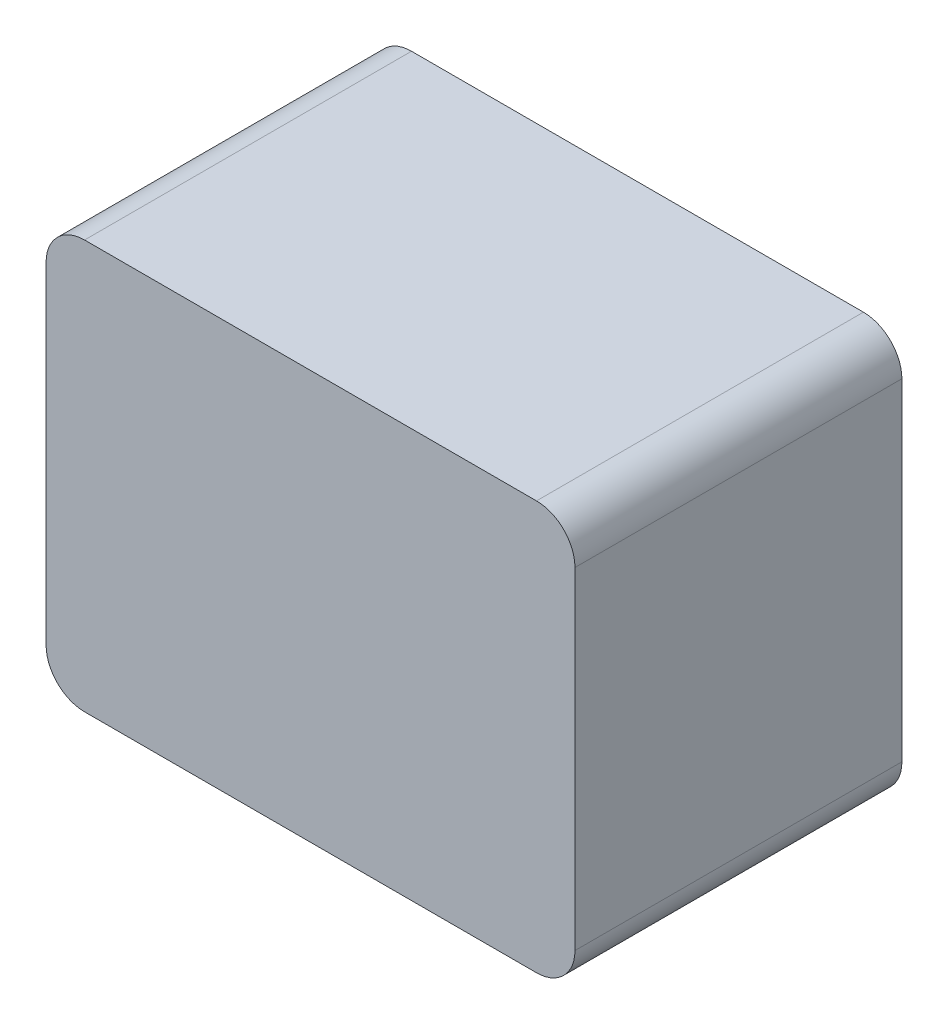
ISO-10303-21;
HEADER;
FILE_DESCRIPTION(('STEP AP214'),'2;1');
FILE_NAME('part.step','',(''),(''),'','','');
FILE_SCHEMA(('AUTOMOTIVE_DESIGN { 1 0 10303 214 1 1 1 1 }'));
ENDSEC;
DATA;
#1=APPLICATION_CONTEXT('core data for automotive mechanical design processes');
#2=APPLICATION_PROTOCOL_DEFINITION('international standard','automotive_design',2000,#1);
#3=PRODUCT_CONTEXT('',#1,'mechanical');
#4=PRODUCT('Part','Part','',(#3));
#5=PRODUCT_RELATED_PRODUCT_CATEGORY('part','',(#4));
#6=PRODUCT_DEFINITION_FORMATION('','',#4);
#7=PRODUCT_DEFINITION_CONTEXT('part definition',#1,'design');
#8=PRODUCT_DEFINITION('design','',#6,#7);
#9=PRODUCT_DEFINITION_SHAPE('','',#8);
#10=(LENGTH_UNIT() NAMED_UNIT(*) SI_UNIT(.MILLI.,.METRE.));
#11=(NAMED_UNIT(*) PLANE_ANGLE_UNIT() SI_UNIT($,.RADIAN.));
#12=(NAMED_UNIT(*) SI_UNIT($,.STERADIAN.) SOLID_ANGLE_UNIT());
#13=UNCERTAINTY_MEASURE_WITH_UNIT(LENGTH_MEASURE(1.E-05),#10,'distance_accuracy_value','');
#14=(GEOMETRIC_REPRESENTATION_CONTEXT(3) GLOBAL_UNCERTAINTY_ASSIGNED_CONTEXT((#13)) GLOBAL_UNIT_ASSIGNED_CONTEXT((#10,
#11,#12)) REPRESENTATION_CONTEXT('',''));
#15=CARTESIAN_POINT('',(0.,0.,0.));
#16=DIRECTION('',(0.,0.,1.));
#17=DIRECTION('',(1.,0.,0.));
#18=AXIS2_PLACEMENT_3D('',#15,#16,#17);
#19=CARTESIAN_POINT('',(-1.2120253164557,-8.88291139240506,68.));
#20=DIRECTION('',(0.,0.,-1.));
#21=DIRECTION('',(-1.,0.,0.));
#22=AXIS2_PLACEMENT_3D('',#19,#20,#21);
#23=CYLINDRICAL_SURFACE('',#22,8.);
#24=CARTESIAN_POINT('',(-1.2120253164557,-8.88291139240506,0.));
#25=DIRECTION('',(0.,0.,1.));
#26=DIRECTION('',(1.,0.,0.));
#27=AXIS2_PLACEMENT_3D('',#24,#25,#26);
#28=CIRCLE('',#27,8.);
#29=CARTESIAN_POINT('',(-1.21202531645575,-16.8829113924051,0.));
#30=VERTEX_POINT('',#29);
#31=CARTESIAN_POINT('',(6.7879746835443,-8.88291139240501,0.));
#32=VERTEX_POINT('',#31);
#33=EDGE_CURVE('E131',#30,#32,#28,.T.);
#34=ORIENTED_EDGE('',*,*,#33,.T.);
#35=DIRECTION('',(0.,0.,-1.));
#36=VECTOR('',#35,1.);
#37=CARTESIAN_POINT('',(6.7879746835443,-8.88291139240501,68.));
#38=LINE('',#37,#36);
#39=CARTESIAN_POINT('',(6.7879746835443,-8.88291139240501,68.));
#40=VERTEX_POINT('',#39);
#41=EDGE_CURVE('E11',#40,#32,#38,.T.);
#42=ORIENTED_EDGE('',*,*,#41,.F.);
#43=CARTESIAN_POINT('',(-1.2120253164557,-8.88291139240506,68.));
#44=DIRECTION('',(0.,0.,1.));
#45=DIRECTION('',(1.,0.,0.));
#46=AXIS2_PLACEMENT_3D('',#43,#44,#45);
#47=CIRCLE('',#46,8.);
#48=CARTESIAN_POINT('',(-1.21202531645575,-16.8829113924051,68.));
#49=VERTEX_POINT('',#48);
#50=EDGE_CURVE('E145',#49,#40,#47,.T.);
#51=ORIENTED_EDGE('',*,*,#50,.F.);
#52=DIRECTION('',(0.,0.,-1.));
#53=VECTOR('',#52,1.);
#54=CARTESIAN_POINT('',(-1.21202531645575,-16.8829113924051,68.));
#55=LINE('',#54,#53);
#56=EDGE_CURVE('E127',#49,#30,#55,.T.);
#57=ORIENTED_EDGE('',*,*,#56,.T.);
#58=EDGE_LOOP('',(#34,#42,#51,#57));
#59=FACE_BOUND('',#58,.T.);
#60=ADVANCED_FACE('F35',(#59),#23,.T.);
#61=CARTESIAN_POINT('',(6.7879746835443,60.1170886075949,68.));
#62=DIRECTION('',(-1.,0.,0.));
#63=DIRECTION('',(0.,-1.,0.));
#64=AXIS2_PLACEMENT_3D('',#61,#62,#63);
#65=PLANE('',#64);
#66=DIRECTION('',(0.,1.,0.));
#67=VECTOR('',#66,1.);
#68=CARTESIAN_POINT('',(6.7879746835443,60.1170886075949,0.));
#69=LINE('',#68,#67);
#70=CARTESIAN_POINT('',(6.7879746835443,60.1170886075949,0.));
#71=VERTEX_POINT('',#70);
#72=EDGE_CURVE('E134',#32,#71,#69,.T.);
#73=ORIENTED_EDGE('',*,*,#72,.T.);
#74=DIRECTION('',(0.,0.,-1.));
#75=VECTOR('',#74,1.);
#76=CARTESIAN_POINT('',(6.7879746835443,60.1170886075949,68.));
#77=LINE('',#76,#75);
#78=CARTESIAN_POINT('',(6.7879746835443,60.1170886075949,68.));
#79=VERTEX_POINT('',#78);
#80=EDGE_CURVE('E43',#79,#71,#77,.T.);
#81=ORIENTED_EDGE('',*,*,#80,.F.);
#82=DIRECTION('',(0.,1.,0.));
#83=VECTOR('',#82,1.);
#84=CARTESIAN_POINT('',(6.7879746835443,60.1170886075949,68.));
#85=LINE('',#84,#83);
#86=EDGE_CURVE('E94',#40,#79,#85,.T.);
#87=ORIENTED_EDGE('',*,*,#86,.F.);
#88=ORIENTED_EDGE('',*,*,#41,.T.);
#89=EDGE_LOOP('',(#73,#81,#87,#88));
#90=FACE_BOUND('',#89,.T.);
#91=ADVANCED_FACE('F180',(#90),#65,.F.);
#92=CARTESIAN_POINT('',(-1.2120253164557,60.1170886075949,68.));
#93=DIRECTION('',(0.,0.,-1.));
#94=DIRECTION('',(-1.,0.,0.));
#95=AXIS2_PLACEMENT_3D('',#92,#93,#94);
#96=CYLINDRICAL_SURFACE('',#95,8.);
#97=CARTESIAN_POINT('',(-1.2120253164557,60.1170886075949,0.));
#98=DIRECTION('',(0.,0.,1.));
#99=DIRECTION('',(-1.,0.,0.));
#100=AXIS2_PLACEMENT_3D('',#97,#98,#99);
#101=CIRCLE('',#100,8.);
#102=CARTESIAN_POINT('',(-1.21202531645576,68.1170886075949,0.));
#103=VERTEX_POINT('',#102);
#104=EDGE_CURVE('E136',#71,#103,#101,.T.);
#105=ORIENTED_EDGE('',*,*,#104,.T.);
#106=DIRECTION('',(0.,0.,-1.));
#107=VECTOR('',#106,1.);
#108=CARTESIAN_POINT('',(-1.21202531645576,68.1170886075949,68.));
#109=LINE('',#108,#107);
#110=CARTESIAN_POINT('',(-1.21202531645576,68.1170886075949,68.));
#111=VERTEX_POINT('',#110);
#112=EDGE_CURVE('E152',#111,#103,#109,.T.);
#113=ORIENTED_EDGE('',*,*,#112,.F.);
#114=CARTESIAN_POINT('',(-1.2120253164557,60.1170886075949,68.));
#115=DIRECTION('',(0.,0.,1.));
#116=DIRECTION('',(-1.,0.,0.));
#117=AXIS2_PLACEMENT_3D('',#114,#115,#116);
#118=CIRCLE('',#117,8.);
#119=EDGE_CURVE('E160',#79,#111,#118,.T.);
#120=ORIENTED_EDGE('',*,*,#119,.F.);
#121=ORIENTED_EDGE('',*,*,#80,.T.);
#122=EDGE_LOOP('',(#105,#113,#120,#121));
#123=FACE_BOUND('',#122,.T.);
#124=ADVANCED_FACE('F158',(#123),#96,.T.);
#125=CARTESIAN_POINT('',(-95.2120253164556,68.1170886075949,68.));
#126=DIRECTION('',(0.,-1.,0.));
#127=DIRECTION('',(0.,0.,-1.));
#128=AXIS2_PLACEMENT_3D('',#125,#126,#127);
#129=PLANE('',#128);
#130=DIRECTION('',(-1.,0.,0.));
#131=VECTOR('',#130,1.);
#132=CARTESIAN_POINT('',(-95.2120253164556,68.1170886075949,0.));
#133=LINE('',#132,#131);
#134=CARTESIAN_POINT('',(-95.2120253164556,68.1170886075949,0.));
#135=VERTEX_POINT('',#134);
#136=EDGE_CURVE('E138',#103,#135,#133,.T.);
#137=ORIENTED_EDGE('',*,*,#136,.T.);
#138=DIRECTION('',(0.,0.,-1.));
#139=VECTOR('',#138,1.);
#140=CARTESIAN_POINT('',(-95.2120253164556,68.1170886075949,68.));
#141=LINE('',#140,#139);
#142=CARTESIAN_POINT('',(-95.2120253164556,68.1170886075949,68.));
#143=VERTEX_POINT('',#142);
#144=EDGE_CURVE('E149',#143,#135,#141,.T.);
#145=ORIENTED_EDGE('',*,*,#144,.F.);
#146=DIRECTION('',(-1.,0.,0.));
#147=VECTOR('',#146,1.);
#148=CARTESIAN_POINT('',(-95.2120253164556,68.1170886075949,68.));
#149=LINE('',#148,#147);
#150=EDGE_CURVE('E172',#111,#143,#149,.T.);
#151=ORIENTED_EDGE('',*,*,#150,.F.);
#152=ORIENTED_EDGE('',*,*,#112,.T.);
#153=EDGE_LOOP('',(#137,#145,#151,#152));
#154=FACE_BOUND('',#153,.T.);
#155=ADVANCED_FACE('F168',(#154),#129,.F.);
#156=CARTESIAN_POINT('',(-95.2120253164557,60.1170886075949,68.));
#157=DIRECTION('',(0.,0.,-1.));
#158=DIRECTION('',(-1.,0.,0.));
#159=AXIS2_PLACEMENT_3D('',#156,#157,#158);
#160=CYLINDRICAL_SURFACE('',#159,8.);
#161=CARTESIAN_POINT('',(-95.2120253164557,60.1170886075949,0.));
#162=DIRECTION('',(0.,0.,1.));
#163=DIRECTION('',(1.,0.,0.));
#164=AXIS2_PLACEMENT_3D('',#161,#162,#163);
#165=CIRCLE('',#164,8.);
#166=CARTESIAN_POINT('',(-103.212025316456,60.1170886075949,0.));
#167=VERTEX_POINT('',#166);
#168=EDGE_CURVE('E140',#135,#167,#165,.T.);
#169=ORIENTED_EDGE('',*,*,#168,.T.);
#170=DIRECTION('',(0.,0.,-1.));
#171=VECTOR('',#170,1.);
#172=CARTESIAN_POINT('',(-103.212025316456,60.1170886075949,68.));
#173=LINE('',#172,#171);
#174=CARTESIAN_POINT('',(-103.212025316456,60.1170886075949,68.));
#175=VERTEX_POINT('',#174);
#176=EDGE_CURVE('E122',#175,#167,#173,.T.);
#177=ORIENTED_EDGE('',*,*,#176,.F.);
#178=CARTESIAN_POINT('',(-95.2120253164557,60.1170886075949,68.));
#179=DIRECTION('',(0.,0.,1.));
#180=DIRECTION('',(1.,0.,0.));
#181=AXIS2_PLACEMENT_3D('',#178,#179,#180);
#182=CIRCLE('',#181,8.);
#183=EDGE_CURVE('E113',#143,#175,#182,.T.);
#184=ORIENTED_EDGE('',*,*,#183,.F.);
#185=ORIENTED_EDGE('',*,*,#144,.T.);
#186=EDGE_LOOP('',(#169,#177,#184,#185));
#187=FACE_BOUND('',#186,.T.);
#188=ADVANCED_FACE('F171',(#187),#160,.T.);
#189=CARTESIAN_POINT('',(-103.212025316456,60.1170886075949,68.));
#190=DIRECTION('',(1.,0.,0.));
#191=DIRECTION('',(0.,0.,-1.));
#192=AXIS2_PLACEMENT_3D('',#189,#190,#191);
#193=PLANE('',#192);
#194=DIRECTION('',(0.,-1.,0.));
#195=VECTOR('',#194,1.);
#196=CARTESIAN_POINT('',(-103.212025316456,60.1170886075949,0.));
#197=LINE('',#196,#195);
#198=CARTESIAN_POINT('',(-103.212025316456,-8.88291139240501,0.));
#199=VERTEX_POINT('',#198);
#200=EDGE_CURVE('E121',#167,#199,#197,.T.);
#201=ORIENTED_EDGE('',*,*,#200,.T.);
#202=DIRECTION('',(0.,0.,-1.));
#203=VECTOR('',#202,1.);
#204=CARTESIAN_POINT('',(-103.212025316456,-8.88291139240501,68.));
#205=LINE('',#204,#203);
#206=CARTESIAN_POINT('',(-103.212025316456,-8.88291139240501,68.));
#207=VERTEX_POINT('',#206);
#208=EDGE_CURVE('E118',#207,#199,#205,.T.);
#209=ORIENTED_EDGE('',*,*,#208,.F.);
#210=DIRECTION('',(0.,-1.,0.));
#211=VECTOR('',#210,1.);
#212=CARTESIAN_POINT('',(-103.212025316456,60.1170886075949,68.));
#213=LINE('',#212,#211);
#214=EDGE_CURVE('E107',#175,#207,#213,.T.);
#215=ORIENTED_EDGE('',*,*,#214,.F.);
#216=ORIENTED_EDGE('',*,*,#176,.T.);
#217=EDGE_LOOP('',(#201,#209,#215,#216));
#218=FACE_BOUND('',#217,.T.);
#219=ADVANCED_FACE('F119',(#218),#193,.F.);
#220=CARTESIAN_POINT('',(-95.2120253164557,-8.88291139240506,68.));
#221=DIRECTION('',(0.,0.,-1.));
#222=DIRECTION('',(-1.,0.,0.));
#223=AXIS2_PLACEMENT_3D('',#220,#221,#222);
#224=CYLINDRICAL_SURFACE('',#223,8.);
#225=CARTESIAN_POINT('',(-95.2120253164557,-8.88291139240506,0.));
#226=DIRECTION('',(0.,0.,1.));
#227=DIRECTION('',(1.,0.,0.));
#228=AXIS2_PLACEMENT_3D('',#225,#226,#227);
#229=CIRCLE('',#228,8.);
#230=CARTESIAN_POINT('',(-95.2120253164556,-16.8829113924051,0.));
#231=VERTEX_POINT('',#230);
#232=EDGE_CURVE('E80',#199,#231,#229,.T.);
#233=ORIENTED_EDGE('',*,*,#232,.T.);
#234=DIRECTION('',(0.,0.,-1.));
#235=VECTOR('',#234,1.);
#236=CARTESIAN_POINT('',(-95.2120253164556,-16.8829113924051,68.));
#237=LINE('',#236,#235);
#238=CARTESIAN_POINT('',(-95.2120253164556,-16.8829113924051,68.));
#239=VERTEX_POINT('',#238);
#240=EDGE_CURVE('E123',#239,#231,#237,.T.);
#241=ORIENTED_EDGE('',*,*,#240,.F.);
#242=CARTESIAN_POINT('',(-95.2120253164557,-8.88291139240506,68.));
#243=DIRECTION('',(0.,0.,1.));
#244=DIRECTION('',(1.,0.,0.));
#245=AXIS2_PLACEMENT_3D('',#242,#243,#244);
#246=CIRCLE('',#245,8.);
#247=EDGE_CURVE('E111',#207,#239,#246,.T.);
#248=ORIENTED_EDGE('',*,*,#247,.F.);
#249=ORIENTED_EDGE('',*,*,#208,.T.);
#250=EDGE_LOOP('',(#233,#241,#248,#249));
#251=FACE_BOUND('',#250,.T.);
#252=ADVANCED_FACE('F125',(#251),#224,.T.);
#253=CARTESIAN_POINT('',(-95.2120253164556,-16.8829113924051,68.));
#254=DIRECTION('',(0.,1.,0.));
#255=DIRECTION('',(0.,0.,1.));
#256=AXIS2_PLACEMENT_3D('',#253,#254,#255);
#257=PLANE('',#256);
#258=DIRECTION('',(1.,0.,0.));
#259=VECTOR('',#258,1.);
#260=CARTESIAN_POINT('',(-95.2120253164556,-16.8829113924051,0.));
#261=LINE('',#260,#259);
#262=EDGE_CURVE('E86',#231,#30,#261,.T.);
#263=ORIENTED_EDGE('',*,*,#262,.T.);
#264=ORIENTED_EDGE('',*,*,#56,.F.);
#265=DIRECTION('',(1.,0.,0.));
#266=VECTOR('',#265,1.);
#267=CARTESIAN_POINT('',(-95.2120253164556,-16.8829113924051,68.));
#268=LINE('',#267,#266);
#269=EDGE_CURVE('E51',#239,#49,#268,.T.);
#270=ORIENTED_EDGE('',*,*,#269,.F.);
#271=ORIENTED_EDGE('',*,*,#240,.T.);
#272=EDGE_LOOP('',(#263,#264,#270,#271));
#273=FACE_BOUND('',#272,.T.);
#274=ADVANCED_FACE('F196',(#273),#257,.F.);
#275=CARTESIAN_POINT('',(-1.2120253164557,-8.88291139240506,68.));
#276=DIRECTION('',(0.,0.,1.));
#277=DIRECTION('',(1.,0.,0.));
#278=AXIS2_PLACEMENT_3D('',#275,#276,#277);
#279=PLANE('',#278);
#280=ORIENTED_EDGE('',*,*,#50,.T.);
#281=ORIENTED_EDGE('',*,*,#86,.T.);
#282=ORIENTED_EDGE('',*,*,#119,.T.);
#283=ORIENTED_EDGE('',*,*,#150,.T.);
#284=ORIENTED_EDGE('',*,*,#183,.T.);
#285=ORIENTED_EDGE('',*,*,#214,.T.);
#286=ORIENTED_EDGE('',*,*,#247,.T.);
#287=ORIENTED_EDGE('',*,*,#269,.T.);
#288=EDGE_LOOP('',(#280,#281,#282,#283,#284,#285,#286,#287));
#289=FACE_BOUND('',#288,.T.);
#290=ADVANCED_FACE('F109',(#289),#279,.T.);
#291=CARTESIAN_POINT('',(-1.2120253164557,-8.88291139240506,0.));
#292=DIRECTION('',(0.,0.,1.));
#293=DIRECTION('',(1.,0.,0.));
#294=AXIS2_PLACEMENT_3D('',#291,#292,#293);
#295=PLANE('',#294);
#296=ORIENTED_EDGE('',*,*,#33,.F.);
#297=ORIENTED_EDGE('',*,*,#262,.F.);
#298=ORIENTED_EDGE('',*,*,#232,.F.);
#299=ORIENTED_EDGE('',*,*,#200,.F.);
#300=ORIENTED_EDGE('',*,*,#168,.F.);
#301=ORIENTED_EDGE('',*,*,#136,.F.);
#302=ORIENTED_EDGE('',*,*,#104,.F.);
#303=ORIENTED_EDGE('',*,*,#72,.F.);
#304=EDGE_LOOP('',(#296,#297,#298,#299,#300,#301,#302,#303));
#305=FACE_BOUND('',#304,.T.);
#306=ADVANCED_FACE('F164',(#305),#295,.F.);
#307=CLOSED_SHELL('',(#60,#91,#124,#155,#188,#219,#252,#274,#290,#306));
#308=MANIFOLD_SOLID_BREP('B2',#307);
#309=ADVANCED_BREP_SHAPE_REPRESENTATION('',(#18,#308),#14);
#310=SHAPE_DEFINITION_REPRESENTATION(#9,#309);
ENDSEC;
END-ISO-10303-21;
